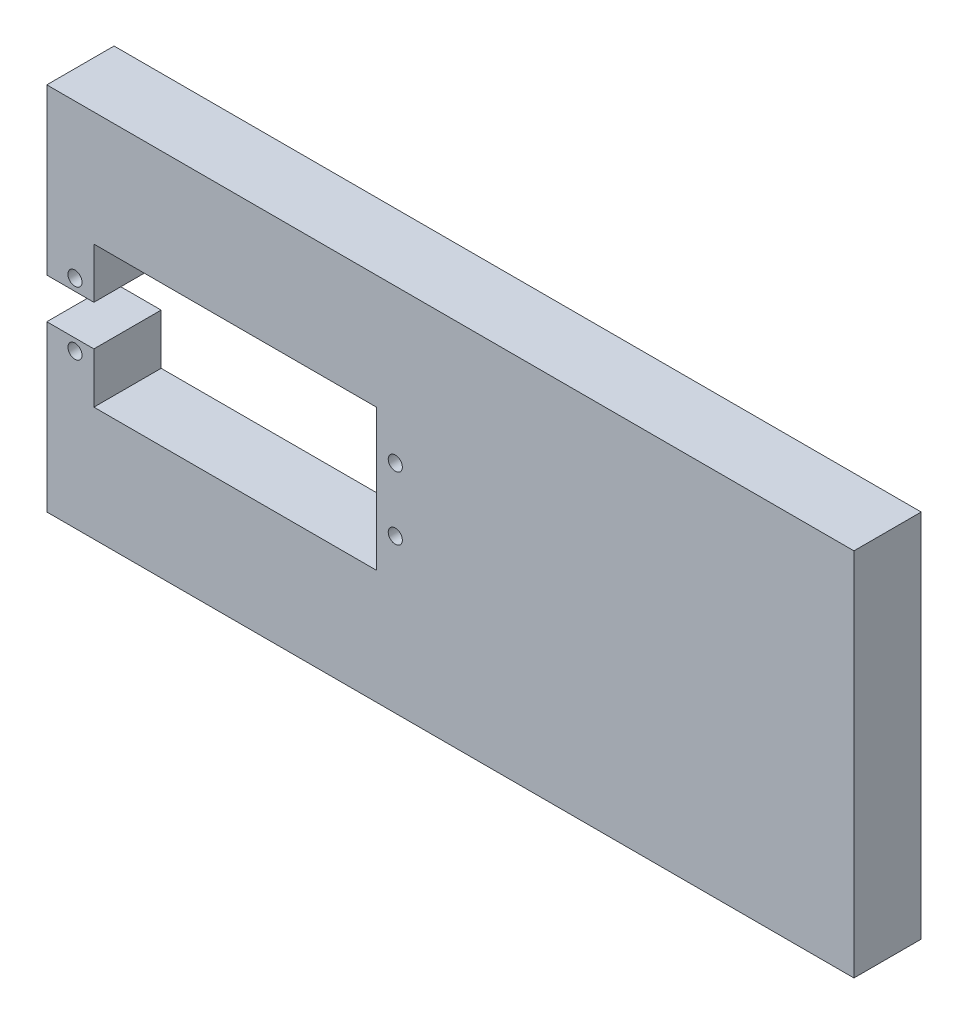
ISO-10303-21;
HEADER;
FILE_DESCRIPTION(('STEP AP214'),'2;1');
FILE_NAME('part.step','',(''),(''),'','','');
FILE_SCHEMA(('AUTOMOTIVE_DESIGN { 1 0 10303 214 1 1 1 1 }'));
ENDSEC;
DATA;
#1=APPLICATION_CONTEXT('core data for automotive mechanical design processes');
#2=APPLICATION_PROTOCOL_DEFINITION('international standard','automotive_design',2000,#1);
#3=PRODUCT_CONTEXT('',#1,'mechanical');
#4=PRODUCT('Part','Part','',(#3));
#5=PRODUCT_RELATED_PRODUCT_CATEGORY('part','',(#4));
#6=PRODUCT_DEFINITION_FORMATION('','',#4);
#7=PRODUCT_DEFINITION_CONTEXT('part definition',#1,'design');
#8=PRODUCT_DEFINITION('design','',#6,#7);
#9=PRODUCT_DEFINITION_SHAPE('','',#8);
#10=(LENGTH_UNIT() NAMED_UNIT(*) SI_UNIT(.MILLI.,.METRE.));
#11=(NAMED_UNIT(*) PLANE_ANGLE_UNIT() SI_UNIT($,.RADIAN.));
#12=(NAMED_UNIT(*) SI_UNIT($,.STERADIAN.) SOLID_ANGLE_UNIT());
#13=UNCERTAINTY_MEASURE_WITH_UNIT(LENGTH_MEASURE(1.E-05),#10,'distance_accuracy_value','');
#14=(GEOMETRIC_REPRESENTATION_CONTEXT(3) GLOBAL_UNCERTAINTY_ASSIGNED_CONTEXT((#13)) GLOBAL_UNIT_ASSIGNED_CONTEXT((#10,
#11,#12)) REPRESENTATION_CONTEXT('',''));
#15=CARTESIAN_POINT('',(0.,0.,0.));
#16=DIRECTION('',(0.,0.,1.));
#17=DIRECTION('',(1.,0.,0.));
#18=AXIS2_PLACEMENT_3D('',#15,#16,#17);
#19=CARTESIAN_POINT('',(0.,0.,10.));
#20=DIRECTION('',(0.,0.,1.));
#21=DIRECTION('',(1.,0.,0.));
#22=AXIS2_PLACEMENT_3D('',#19,#20,#21);
#23=PLANE('',#22);
#24=CARTESIAN_POINT('',(-55.81,-4.7,10.));
#25=DIRECTION('',(0.,0.,1.));
#26=DIRECTION('',(-1.,0.,0.));
#27=AXIS2_PLACEMENT_3D('',#24,#25,#26);
#28=CIRCLE('',#27,1.05);
#29=CARTESIAN_POINT('',(-56.86,-4.7,10.));
#30=VERTEX_POINT('',#29);
#31=EDGE_CURVE('E295',#30,#30,#28,.T.);
#32=ORIENTED_EDGE('',*,*,#31,.F.);
#33=EDGE_LOOP('',(#32));
#34=FACE_BOUND('',#33,.T.);
#35=CARTESIAN_POINT('',(-55.81,4.7,10.));
#36=DIRECTION('',(0.,0.,1.));
#37=DIRECTION('',(1.,0.,0.));
#38=AXIS2_PLACEMENT_3D('',#35,#36,#37);
#39=CIRCLE('',#38,1.05);
#40=CARTESIAN_POINT('',(-54.76,4.7,10.));
#41=VERTEX_POINT('',#40);
#42=EDGE_CURVE('E162',#41,#41,#39,.T.);
#43=ORIENTED_EDGE('',*,*,#42,.F.);
#44=EDGE_LOOP('',(#43));
#45=FACE_BOUND('',#44,.T.);
#46=DIRECTION('',(0.,-1.,0.));
#47=VECTOR('',#46,1.);
#48=CARTESIAN_POINT('',(-60.,27.5,10.));
#49=LINE('',#48,#47);
#50=CARTESIAN_POINT('',(-60.,27.5,10.));
#51=VERTEX_POINT('',#50);
#52=CARTESIAN_POINT('',(-60.,3.,10.));
#53=VERTEX_POINT('',#52);
#54=EDGE_CURVE('E181',#51,#53,#49,.T.);
#55=ORIENTED_EDGE('',*,*,#54,.T.);
#56=DIRECTION('',(1.,0.,0.));
#57=VECTOR('',#56,1.);
#58=CARTESIAN_POINT('',(-60.,3.,10.));
#59=LINE('',#58,#57);
#60=CARTESIAN_POINT('',(-53.,3.,10.));
#61=VERTEX_POINT('',#60);
#62=EDGE_CURVE('E109',#53,#61,#59,.T.);
#63=ORIENTED_EDGE('',*,*,#62,.T.);
#64=DIRECTION('',(0.,1.,0.));
#65=VECTOR('',#64,1.);
#66=CARTESIAN_POINT('',(-53.,10.5,10.));
#67=LINE('',#66,#65);
#68=CARTESIAN_POINT('',(-53.,10.5,10.));
#69=VERTEX_POINT('',#68);
#70=EDGE_CURVE('E208',#61,#69,#67,.T.);
#71=ORIENTED_EDGE('',*,*,#70,.T.);
#72=DIRECTION('',(1.,0.,0.));
#73=VECTOR('',#72,1.);
#74=CARTESIAN_POINT('',(-53.,10.5,10.));
#75=LINE('',#74,#73);
#76=CARTESIAN_POINT('',(-11.,10.5,10.));
#77=VERTEX_POINT('',#76);
#78=EDGE_CURVE('E227',#69,#77,#75,.T.);
#79=ORIENTED_EDGE('',*,*,#78,.T.);
#80=DIRECTION('',(0.,-1.,0.));
#81=VECTOR('',#80,1.);
#82=CARTESIAN_POINT('',(-11.,10.5,10.));
#83=LINE('',#82,#81);
#84=CARTESIAN_POINT('',(-11.,-10.5,10.));
#85=VERTEX_POINT('',#84);
#86=EDGE_CURVE('E224',#77,#85,#83,.T.);
#87=ORIENTED_EDGE('',*,*,#86,.T.);
#88=DIRECTION('',(-1.,0.,0.));
#89=VECTOR('',#88,1.);
#90=CARTESIAN_POINT('',(-53.,-10.5,10.));
#91=LINE('',#90,#89);
#92=CARTESIAN_POINT('',(-53.,-10.5,10.));
#93=VERTEX_POINT('',#92);
#94=EDGE_CURVE('E226',#85,#93,#91,.T.);
#95=ORIENTED_EDGE('',*,*,#94,.T.);
#96=DIRECTION('',(0.,1.,0.));
#97=VECTOR('',#96,1.);
#98=CARTESIAN_POINT('',(-53.,-3.,10.));
#99=LINE('',#98,#97);
#100=CARTESIAN_POINT('',(-53.,-3.,10.));
#101=VERTEX_POINT('',#100);
#102=EDGE_CURVE('E229',#93,#101,#99,.T.);
#103=ORIENTED_EDGE('',*,*,#102,.T.);
#104=DIRECTION('',(-1.,0.,0.));
#105=VECTOR('',#104,1.);
#106=CARTESIAN_POINT('',(-60.,-3.,10.));
#107=LINE('',#106,#105);
#108=CARTESIAN_POINT('',(-60.,-3.,10.));
#109=VERTEX_POINT('',#108);
#110=EDGE_CURVE('E235',#101,#109,#107,.T.);
#111=ORIENTED_EDGE('',*,*,#110,.T.);
#112=DIRECTION('',(0.,-1.,0.));
#113=VECTOR('',#112,1.);
#114=CARTESIAN_POINT('',(-60.,-3.,10.));
#115=LINE('',#114,#113);
#116=CARTESIAN_POINT('',(-60.,-27.5,10.));
#117=VERTEX_POINT('',#116);
#118=EDGE_CURVE('E140',#109,#117,#115,.T.);
#119=ORIENTED_EDGE('',*,*,#118,.T.);
#120=DIRECTION('',(1.,0.,0.));
#121=VECTOR('',#120,1.);
#122=CARTESIAN_POINT('',(-60.,-27.5,10.));
#123=LINE('',#122,#121);
#124=CARTESIAN_POINT('',(60.,-27.5,10.));
#125=VERTEX_POINT('',#124);
#126=EDGE_CURVE('E134',#117,#125,#123,.T.);
#127=ORIENTED_EDGE('',*,*,#126,.T.);
#128=DIRECTION('',(0.,1.,0.));
#129=VECTOR('',#128,1.);
#130=CARTESIAN_POINT('',(60.,27.5,10.));
#131=LINE('',#130,#129);
#132=CARTESIAN_POINT('',(60.,27.5,10.));
#133=VERTEX_POINT('',#132);
#134=EDGE_CURVE('E138',#125,#133,#131,.T.);
#135=ORIENTED_EDGE('',*,*,#134,.T.);
#136=DIRECTION('',(-1.,0.,0.));
#137=VECTOR('',#136,1.);
#138=CARTESIAN_POINT('',(-60.,27.5,10.));
#139=LINE('',#138,#137);
#140=EDGE_CURVE('E54',#133,#51,#139,.T.);
#141=ORIENTED_EDGE('',*,*,#140,.T.);
#142=EDGE_LOOP('',(#55,#63,#71,#79,#87,#95,#103,#111,#119,#127,#135,#141));
#143=FACE_BOUND('',#142,.T.);
#144=CARTESIAN_POINT('',(-8.19,4.7,10.));
#145=DIRECTION('',(0.,0.,1.));
#146=DIRECTION('',(1.,0.,0.));
#147=AXIS2_PLACEMENT_3D('',#144,#145,#146);
#148=CIRCLE('',#147,1.05);
#149=CARTESIAN_POINT('',(-7.14,4.7,10.));
#150=VERTEX_POINT('',#149);
#151=EDGE_CURVE('E301',#150,#150,#148,.T.);
#152=ORIENTED_EDGE('',*,*,#151,.F.);
#153=EDGE_LOOP('',(#152));
#154=FACE_BOUND('',#153,.T.);
#155=CARTESIAN_POINT('',(-8.19,-4.7,10.));
#156=DIRECTION('',(0.,0.,1.));
#157=DIRECTION('',(-1.,0.,0.));
#158=AXIS2_PLACEMENT_3D('',#155,#156,#157);
#159=CIRCLE('',#158,1.05);
#160=CARTESIAN_POINT('',(-9.24,-4.7,10.));
#161=VERTEX_POINT('',#160);
#162=EDGE_CURVE('E286',#161,#161,#159,.T.);
#163=ORIENTED_EDGE('',*,*,#162,.F.);
#164=EDGE_LOOP('',(#163));
#165=FACE_BOUND('',#164,.T.);
#166=ADVANCED_FACE('F37',(#34,#45,#143,#154,#165),#23,.T.);
#167=CARTESIAN_POINT('',(0.,0.,0.));
#168=DIRECTION('',(0.,0.,1.));
#169=DIRECTION('',(1.,0.,0.));
#170=AXIS2_PLACEMENT_3D('',#167,#168,#169);
#171=PLANE('',#170);
#172=DIRECTION('',(0.,-1.,0.));
#173=VECTOR('',#172,1.);
#174=CARTESIAN_POINT('',(-60.,27.5,0.));
#175=LINE('',#174,#173);
#176=CARTESIAN_POINT('',(-60.,27.5,0.));
#177=VERTEX_POINT('',#176);
#178=CARTESIAN_POINT('',(-60.,3.,0.));
#179=VERTEX_POINT('',#178);
#180=EDGE_CURVE('E158',#177,#179,#175,.T.);
#181=ORIENTED_EDGE('',*,*,#180,.F.);
#182=DIRECTION('',(-1.,0.,0.));
#183=VECTOR('',#182,1.);
#184=CARTESIAN_POINT('',(-60.,27.5,0.));
#185=LINE('',#184,#183);
#186=CARTESIAN_POINT('',(60.,27.5,0.));
#187=VERTEX_POINT('',#186);
#188=EDGE_CURVE('E101',#187,#177,#185,.T.);
#189=ORIENTED_EDGE('',*,*,#188,.F.);
#190=DIRECTION('',(0.,1.,0.));
#191=VECTOR('',#190,1.);
#192=CARTESIAN_POINT('',(60.,27.5,0.));
#193=LINE('',#192,#191);
#194=CARTESIAN_POINT('',(60.,-27.5,0.));
#195=VERTEX_POINT('',#194);
#196=EDGE_CURVE('E95',#195,#187,#193,.T.);
#197=ORIENTED_EDGE('',*,*,#196,.F.);
#198=DIRECTION('',(1.,0.,0.));
#199=VECTOR('',#198,1.);
#200=CARTESIAN_POINT('',(-60.,-27.5,0.));
#201=LINE('',#200,#199);
#202=CARTESIAN_POINT('',(-60.,-27.5,0.));
#203=VERTEX_POINT('',#202);
#204=EDGE_CURVE('E148',#203,#195,#201,.T.);
#205=ORIENTED_EDGE('',*,*,#204,.F.);
#206=DIRECTION('',(0.,-1.,0.));
#207=VECTOR('',#206,1.);
#208=CARTESIAN_POINT('',(-60.,-3.,0.));
#209=LINE('',#208,#207);
#210=CARTESIAN_POINT('',(-60.,-3.,0.));
#211=VERTEX_POINT('',#210);
#212=EDGE_CURVE('E176',#211,#203,#209,.T.);
#213=ORIENTED_EDGE('',*,*,#212,.F.);
#214=DIRECTION('',(-1.,0.,0.));
#215=VECTOR('',#214,1.);
#216=CARTESIAN_POINT('',(-60.,-3.,0.));
#217=LINE('',#216,#215);
#218=CARTESIAN_POINT('',(-53.,-3.,0.));
#219=VERTEX_POINT('',#218);
#220=EDGE_CURVE('E174',#219,#211,#217,.T.);
#221=ORIENTED_EDGE('',*,*,#220,.F.);
#222=DIRECTION('',(0.,1.,0.));
#223=VECTOR('',#222,1.);
#224=CARTESIAN_POINT('',(-53.,-3.,0.));
#225=LINE('',#224,#223);
#226=CARTESIAN_POINT('',(-53.,-10.5,0.));
#227=VERTEX_POINT('',#226);
#228=EDGE_CURVE('E172',#227,#219,#225,.T.);
#229=ORIENTED_EDGE('',*,*,#228,.F.);
#230=DIRECTION('',(-1.,0.,0.));
#231=VECTOR('',#230,1.);
#232=CARTESIAN_POINT('',(-53.,-10.5,0.));
#233=LINE('',#232,#231);
#234=CARTESIAN_POINT('',(-11.,-10.5,0.));
#235=VERTEX_POINT('',#234);
#236=EDGE_CURVE('E170',#235,#227,#233,.T.);
#237=ORIENTED_EDGE('',*,*,#236,.F.);
#238=DIRECTION('',(0.,-1.,0.));
#239=VECTOR('',#238,1.);
#240=CARTESIAN_POINT('',(-11.,10.5,0.));
#241=LINE('',#240,#239);
#242=CARTESIAN_POINT('',(-11.,10.5,0.));
#243=VERTEX_POINT('',#242);
#244=EDGE_CURVE('E168',#243,#235,#241,.T.);
#245=ORIENTED_EDGE('',*,*,#244,.F.);
#246=DIRECTION('',(1.,0.,0.));
#247=VECTOR('',#246,1.);
#248=CARTESIAN_POINT('',(-53.,10.5,0.));
#249=LINE('',#248,#247);
#250=CARTESIAN_POINT('',(-53.,10.5,0.));
#251=VERTEX_POINT('',#250);
#252=EDGE_CURVE('E166',#251,#243,#249,.T.);
#253=ORIENTED_EDGE('',*,*,#252,.F.);
#254=DIRECTION('',(0.,1.,0.));
#255=VECTOR('',#254,1.);
#256=CARTESIAN_POINT('',(-53.,10.5,0.));
#257=LINE('',#256,#255);
#258=CARTESIAN_POINT('',(-53.,3.,0.));
#259=VERTEX_POINT('',#258);
#260=EDGE_CURVE('E164',#259,#251,#257,.T.);
#261=ORIENTED_EDGE('',*,*,#260,.F.);
#262=DIRECTION('',(1.,0.,0.));
#263=VECTOR('',#262,1.);
#264=CARTESIAN_POINT('',(-60.,3.,0.));
#265=LINE('',#264,#263);
#266=EDGE_CURVE('E161',#179,#259,#265,.T.);
#267=ORIENTED_EDGE('',*,*,#266,.F.);
#268=EDGE_LOOP('',(#181,#189,#197,#205,#213,#221,#229,#237,#245,#253,#261,#267));
#269=FACE_BOUND('',#268,.T.);
#270=CARTESIAN_POINT('',(-55.81,4.7,0.));
#271=DIRECTION('',(0.,0.,1.));
#272=DIRECTION('',(1.,0.,0.));
#273=AXIS2_PLACEMENT_3D('',#270,#271,#272);
#274=CIRCLE('',#273,1.05);
#275=CARTESIAN_POINT('',(-54.76,4.7,0.));
#276=VERTEX_POINT('',#275);
#277=EDGE_CURVE('E304',#276,#276,#274,.T.);
#278=ORIENTED_EDGE('',*,*,#277,.T.);
#279=EDGE_LOOP('',(#278));
#280=FACE_BOUND('',#279,.T.);
#281=CARTESIAN_POINT('',(-8.19,4.7,0.));
#282=DIRECTION('',(0.,0.,1.));
#283=DIRECTION('',(1.,0.,0.));
#284=AXIS2_PLACEMENT_3D('',#281,#282,#283);
#285=CIRCLE('',#284,1.05);
#286=CARTESIAN_POINT('',(-7.14,4.7,0.));
#287=VERTEX_POINT('',#286);
#288=EDGE_CURVE('E298',#287,#287,#285,.T.);
#289=ORIENTED_EDGE('',*,*,#288,.T.);
#290=EDGE_LOOP('',(#289));
#291=FACE_BOUND('',#290,.T.);
#292=CARTESIAN_POINT('',(-55.81,-4.7,0.));
#293=DIRECTION('',(0.,0.,1.));
#294=DIRECTION('',(-1.,0.,0.));
#295=AXIS2_PLACEMENT_3D('',#292,#293,#294);
#296=CIRCLE('',#295,1.05);
#297=CARTESIAN_POINT('',(-56.86,-4.7,0.));
#298=VERTEX_POINT('',#297);
#299=EDGE_CURVE('E292',#298,#298,#296,.T.);
#300=ORIENTED_EDGE('',*,*,#299,.T.);
#301=EDGE_LOOP('',(#300));
#302=FACE_BOUND('',#301,.T.);
#303=CARTESIAN_POINT('',(-8.19,-4.7,0.));
#304=DIRECTION('',(0.,0.,1.));
#305=DIRECTION('',(-1.,0.,0.));
#306=AXIS2_PLACEMENT_3D('',#303,#304,#305);
#307=CIRCLE('',#306,1.05);
#308=CARTESIAN_POINT('',(-9.24,-4.7,0.));
#309=VERTEX_POINT('',#308);
#310=EDGE_CURVE('E289',#309,#309,#307,.T.);
#311=ORIENTED_EDGE('',*,*,#310,.T.);
#312=EDGE_LOOP('',(#311));
#313=FACE_BOUND('',#312,.T.);
#314=ADVANCED_FACE('F212',(#269,#280,#291,#302,#313),#171,.F.);
#315=CARTESIAN_POINT('',(-60.,27.5,10.));
#316=DIRECTION('',(1.,0.,0.));
#317=DIRECTION('',(0.,0.,-1.));
#318=AXIS2_PLACEMENT_3D('',#315,#316,#317);
#319=PLANE('',#318);
#320=ORIENTED_EDGE('',*,*,#180,.T.);
#321=DIRECTION('',(0.,0.,-1.));
#322=VECTOR('',#321,1.);
#323=CARTESIAN_POINT('',(-60.,3.,10.));
#324=LINE('',#323,#322);
#325=EDGE_CURVE('E11',#53,#179,#324,.T.);
#326=ORIENTED_EDGE('',*,*,#325,.F.);
#327=ORIENTED_EDGE('',*,*,#54,.F.);
#328=DIRECTION('',(0.,0.,-1.));
#329=VECTOR('',#328,1.);
#330=CARTESIAN_POINT('',(-60.,27.5,10.));
#331=LINE('',#330,#329);
#332=EDGE_CURVE('E154',#51,#177,#331,.T.);
#333=ORIENTED_EDGE('',*,*,#332,.T.);
#334=EDGE_LOOP('',(#320,#326,#327,#333));
#335=FACE_BOUND('',#334,.T.);
#336=ADVANCED_FACE('F39',(#335),#319,.F.);
#337=CARTESIAN_POINT('',(-60.,3.,10.));
#338=DIRECTION('',(0.,1.,0.));
#339=DIRECTION('',(0.,0.,1.));
#340=AXIS2_PLACEMENT_3D('',#337,#338,#339);
#341=PLANE('',#340);
#342=ORIENTED_EDGE('',*,*,#266,.T.);
#343=DIRECTION('',(0.,0.,-1.));
#344=VECTOR('',#343,1.);
#345=CARTESIAN_POINT('',(-53.,3.,10.));
#346=LINE('',#345,#344);
#347=EDGE_CURVE('E46',#61,#259,#346,.T.);
#348=ORIENTED_EDGE('',*,*,#347,.F.);
#349=ORIENTED_EDGE('',*,*,#62,.F.);
#350=ORIENTED_EDGE('',*,*,#325,.T.);
#351=EDGE_LOOP('',(#342,#348,#349,#350));
#352=FACE_BOUND('',#351,.T.);
#353=ADVANCED_FACE('F414',(#352),#341,.F.);
#354=CARTESIAN_POINT('',(-53.,10.5,10.));
#355=DIRECTION('',(-1.,0.,0.));
#356=DIRECTION('',(0.,0.,1.));
#357=AXIS2_PLACEMENT_3D('',#354,#355,#356);
#358=PLANE('',#357);
#359=ORIENTED_EDGE('',*,*,#260,.T.);
#360=DIRECTION('',(0.,0.,-1.));
#361=VECTOR('',#360,1.);
#362=CARTESIAN_POINT('',(-53.,10.5,10.));
#363=LINE('',#362,#361);
#364=EDGE_CURVE('E200',#69,#251,#363,.T.);
#365=ORIENTED_EDGE('',*,*,#364,.F.);
#366=ORIENTED_EDGE('',*,*,#70,.F.);
#367=ORIENTED_EDGE('',*,*,#347,.T.);
#368=EDGE_LOOP('',(#359,#365,#366,#367));
#369=FACE_BOUND('',#368,.T.);
#370=ADVANCED_FACE('F206',(#369),#358,.F.);
#371=CARTESIAN_POINT('',(-53.,10.5,10.));
#372=DIRECTION('',(0.,1.,0.));
#373=DIRECTION('',(0.,0.,1.));
#374=AXIS2_PLACEMENT_3D('',#371,#372,#373);
#375=PLANE('',#374);
#376=ORIENTED_EDGE('',*,*,#252,.T.);
#377=DIRECTION('',(0.,0.,-1.));
#378=VECTOR('',#377,1.);
#379=CARTESIAN_POINT('',(-11.,10.5,10.));
#380=LINE('',#379,#378);
#381=EDGE_CURVE('E197',#77,#243,#380,.T.);
#382=ORIENTED_EDGE('',*,*,#381,.F.);
#383=ORIENTED_EDGE('',*,*,#78,.F.);
#384=ORIENTED_EDGE('',*,*,#364,.T.);
#385=EDGE_LOOP('',(#376,#382,#383,#384));
#386=FACE_BOUND('',#385,.T.);
#387=ADVANCED_FACE('F218',(#386),#375,.F.);
#388=CARTESIAN_POINT('',(-11.,10.5,10.));
#389=DIRECTION('',(1.,0.,0.));
#390=DIRECTION('',(0.,0.,-1.));
#391=AXIS2_PLACEMENT_3D('',#388,#389,#390);
#392=PLANE('',#391);
#393=ORIENTED_EDGE('',*,*,#244,.T.);
#394=DIRECTION('',(0.,0.,-1.));
#395=VECTOR('',#394,1.);
#396=CARTESIAN_POINT('',(-11.,-10.5,10.));
#397=LINE('',#396,#395);
#398=EDGE_CURVE('E194',#85,#235,#397,.T.);
#399=ORIENTED_EDGE('',*,*,#398,.F.);
#400=ORIENTED_EDGE('',*,*,#86,.F.);
#401=ORIENTED_EDGE('',*,*,#381,.T.);
#402=EDGE_LOOP('',(#393,#399,#400,#401));
#403=FACE_BOUND('',#402,.T.);
#404=ADVANCED_FACE('F222',(#403),#392,.F.);
#405=CARTESIAN_POINT('',(-53.,-10.5,10.));
#406=DIRECTION('',(0.,-1.,0.));
#407=DIRECTION('',(0.,0.,-1.));
#408=AXIS2_PLACEMENT_3D('',#405,#406,#407);
#409=PLANE('',#408);
#410=ORIENTED_EDGE('',*,*,#236,.T.);
#411=DIRECTION('',(0.,0.,-1.));
#412=VECTOR('',#411,1.);
#413=CARTESIAN_POINT('',(-53.,-10.5,10.));
#414=LINE('',#413,#412);
#415=EDGE_CURVE('E191',#93,#227,#414,.T.);
#416=ORIENTED_EDGE('',*,*,#415,.F.);
#417=ORIENTED_EDGE('',*,*,#94,.F.);
#418=ORIENTED_EDGE('',*,*,#398,.T.);
#419=EDGE_LOOP('',(#410,#416,#417,#418));
#420=FACE_BOUND('',#419,.T.);
#421=ADVANCED_FACE('F379',(#420),#409,.F.);
#422=CARTESIAN_POINT('',(-53.,-3.,10.));
#423=DIRECTION('',(-1.,0.,0.));
#424=DIRECTION('',(0.,0.,1.));
#425=AXIS2_PLACEMENT_3D('',#422,#423,#424);
#426=PLANE('',#425);
#427=ORIENTED_EDGE('',*,*,#228,.T.);
#428=DIRECTION('',(0.,0.,-1.));
#429=VECTOR('',#428,1.);
#430=CARTESIAN_POINT('',(-53.,-3.,10.));
#431=LINE('',#430,#429);
#432=EDGE_CURVE('E188',#101,#219,#431,.T.);
#433=ORIENTED_EDGE('',*,*,#432,.F.);
#434=ORIENTED_EDGE('',*,*,#102,.F.);
#435=ORIENTED_EDGE('',*,*,#415,.T.);
#436=EDGE_LOOP('',(#427,#433,#434,#435));
#437=FACE_BOUND('',#436,.T.);
#438=ADVANCED_FACE('F370',(#437),#426,.F.);
#439=CARTESIAN_POINT('',(-60.,-3.,10.));
#440=DIRECTION('',(0.,-1.,0.));
#441=DIRECTION('',(0.,0.,-1.));
#442=AXIS2_PLACEMENT_3D('',#439,#440,#441);
#443=PLANE('',#442);
#444=ORIENTED_EDGE('',*,*,#220,.T.);
#445=DIRECTION('',(0.,0.,-1.));
#446=VECTOR('',#445,1.);
#447=CARTESIAN_POINT('',(-60.,-3.,10.));
#448=LINE('',#447,#446);
#449=EDGE_CURVE('E185',#109,#211,#448,.T.);
#450=ORIENTED_EDGE('',*,*,#449,.F.);
#451=ORIENTED_EDGE('',*,*,#110,.F.);
#452=ORIENTED_EDGE('',*,*,#432,.T.);
#453=EDGE_LOOP('',(#444,#450,#451,#452));
#454=FACE_BOUND('',#453,.T.);
#455=ADVANCED_FACE('F241',(#454),#443,.F.);
#456=CARTESIAN_POINT('',(-60.,-3.,10.));
#457=DIRECTION('',(1.,0.,0.));
#458=DIRECTION('',(0.,1.,0.));
#459=AXIS2_PLACEMENT_3D('',#456,#457,#458);
#460=PLANE('',#459);
#461=ORIENTED_EDGE('',*,*,#212,.T.);
#462=DIRECTION('',(0.,0.,-1.));
#463=VECTOR('',#462,1.);
#464=CARTESIAN_POINT('',(-60.,-27.5,10.));
#465=LINE('',#464,#463);
#466=EDGE_CURVE('E149',#117,#203,#465,.T.);
#467=ORIENTED_EDGE('',*,*,#466,.F.);
#468=ORIENTED_EDGE('',*,*,#118,.F.);
#469=ORIENTED_EDGE('',*,*,#449,.T.);
#470=EDGE_LOOP('',(#461,#467,#468,#469));
#471=FACE_BOUND('',#470,.T.);
#472=ADVANCED_FACE('F245',(#471),#460,.F.);
#473=CARTESIAN_POINT('',(-60.,-27.5,10.));
#474=DIRECTION('',(0.,1.,0.));
#475=DIRECTION('',(0.,0.,1.));
#476=AXIS2_PLACEMENT_3D('',#473,#474,#475);
#477=PLANE('',#476);
#478=ORIENTED_EDGE('',*,*,#204,.T.);
#479=DIRECTION('',(0.,0.,-1.));
#480=VECTOR('',#479,1.);
#481=CARTESIAN_POINT('',(60.,-27.5,10.));
#482=LINE('',#481,#480);
#483=EDGE_CURVE('E145',#125,#195,#482,.T.);
#484=ORIENTED_EDGE('',*,*,#483,.F.);
#485=ORIENTED_EDGE('',*,*,#126,.F.);
#486=ORIENTED_EDGE('',*,*,#466,.T.);
#487=EDGE_LOOP('',(#478,#484,#485,#486));
#488=FACE_BOUND('',#487,.T.);
#489=ADVANCED_FACE('F146',(#488),#477,.F.);
#490=CARTESIAN_POINT('',(60.,27.5,10.));
#491=DIRECTION('',(-1.,0.,0.));
#492=DIRECTION('',(0.,0.,1.));
#493=AXIS2_PLACEMENT_3D('',#490,#491,#492);
#494=PLANE('',#493);
#495=ORIENTED_EDGE('',*,*,#196,.T.);
#496=DIRECTION('',(0.,0.,-1.));
#497=VECTOR('',#496,1.);
#498=CARTESIAN_POINT('',(60.,27.5,10.));
#499=LINE('',#498,#497);
#500=EDGE_CURVE('E150',#133,#187,#499,.T.);
#501=ORIENTED_EDGE('',*,*,#500,.F.);
#502=ORIENTED_EDGE('',*,*,#134,.F.);
#503=ORIENTED_EDGE('',*,*,#483,.T.);
#504=EDGE_LOOP('',(#495,#501,#502,#503));
#505=FACE_BOUND('',#504,.T.);
#506=ADVANCED_FACE('F152',(#505),#494,.F.);
#507=CARTESIAN_POINT('',(-60.,27.5,10.));
#508=DIRECTION('',(0.,-1.,0.));
#509=DIRECTION('',(0.,0.,-1.));
#510=AXIS2_PLACEMENT_3D('',#507,#508,#509);
#511=PLANE('',#510);
#512=ORIENTED_EDGE('',*,*,#188,.T.);
#513=ORIENTED_EDGE('',*,*,#332,.F.);
#514=ORIENTED_EDGE('',*,*,#140,.F.);
#515=ORIENTED_EDGE('',*,*,#500,.T.);
#516=EDGE_LOOP('',(#512,#513,#514,#515));
#517=FACE_BOUND('',#516,.T.);
#518=ADVANCED_FACE('F249',(#517),#511,.F.);
#519=CARTESIAN_POINT('',(-55.81,4.7,10.));
#520=DIRECTION('',(0.,0.,-1.));
#521=DIRECTION('',(-1.,0.,0.));
#522=AXIS2_PLACEMENT_3D('',#519,#520,#521);
#523=CYLINDRICAL_SURFACE('',#522,1.05);
#524=ORIENTED_EDGE('',*,*,#42,.T.);
#525=EDGE_LOOP('',(#524));
#526=FACE_BOUND('',#525,.T.);
#527=ORIENTED_EDGE('',*,*,#277,.F.);
#528=EDGE_LOOP('',(#527));
#529=FACE_BOUND('',#528,.T.);
#530=ADVANCED_FACE('F251',(#526,#529),#523,.F.);
#531=CARTESIAN_POINT('',(-8.19,4.7,10.));
#532=DIRECTION('',(0.,0.,-1.));
#533=DIRECTION('',(-1.,0.,0.));
#534=AXIS2_PLACEMENT_3D('',#531,#532,#533);
#535=CYLINDRICAL_SURFACE('',#534,1.05);
#536=ORIENTED_EDGE('',*,*,#151,.T.);
#537=EDGE_LOOP('',(#536));
#538=FACE_BOUND('',#537,.T.);
#539=ORIENTED_EDGE('',*,*,#288,.F.);
#540=EDGE_LOOP('',(#539));
#541=FACE_BOUND('',#540,.T.);
#542=ADVANCED_FACE('F257',(#538,#541),#535,.F.);
#543=CARTESIAN_POINT('',(-55.81,-4.7,10.));
#544=DIRECTION('',(0.,0.,-1.));
#545=DIRECTION('',(-1.,0.,0.));
#546=AXIS2_PLACEMENT_3D('',#543,#544,#545);
#547=CYLINDRICAL_SURFACE('',#546,1.05);
#548=ORIENTED_EDGE('',*,*,#31,.T.);
#549=EDGE_LOOP('',(#548));
#550=FACE_BOUND('',#549,.T.);
#551=ORIENTED_EDGE('',*,*,#299,.F.);
#552=EDGE_LOOP('',(#551));
#553=FACE_BOUND('',#552,.T.);
#554=ADVANCED_FACE('F273',(#550,#553),#547,.F.);
#555=CARTESIAN_POINT('',(-8.19,-4.7,10.));
#556=DIRECTION('',(0.,0.,-1.));
#557=DIRECTION('',(-1.,0.,0.));
#558=AXIS2_PLACEMENT_3D('',#555,#556,#557);
#559=CYLINDRICAL_SURFACE('',#558,1.05);
#560=ORIENTED_EDGE('',*,*,#162,.T.);
#561=EDGE_LOOP('',(#560));
#562=FACE_BOUND('',#561,.T.);
#563=ORIENTED_EDGE('',*,*,#310,.F.);
#564=EDGE_LOOP('',(#563));
#565=FACE_BOUND('',#564,.T.);
#566=ADVANCED_FACE('F277',(#562,#565),#559,.F.);
#567=CLOSED_SHELL('',(#166,#314,#336,#353,#370,#387,#404,#421,#438,#455,#472,#489,#506,#518,
#530,#542,#554,#566));
#568=MANIFOLD_SOLID_BREP('B2',#567);
#569=ADVANCED_BREP_SHAPE_REPRESENTATION('',(#18,#568),#14);
#570=SHAPE_DEFINITION_REPRESENTATION(#9,#569);
ENDSEC;
END-ISO-10303-21;
